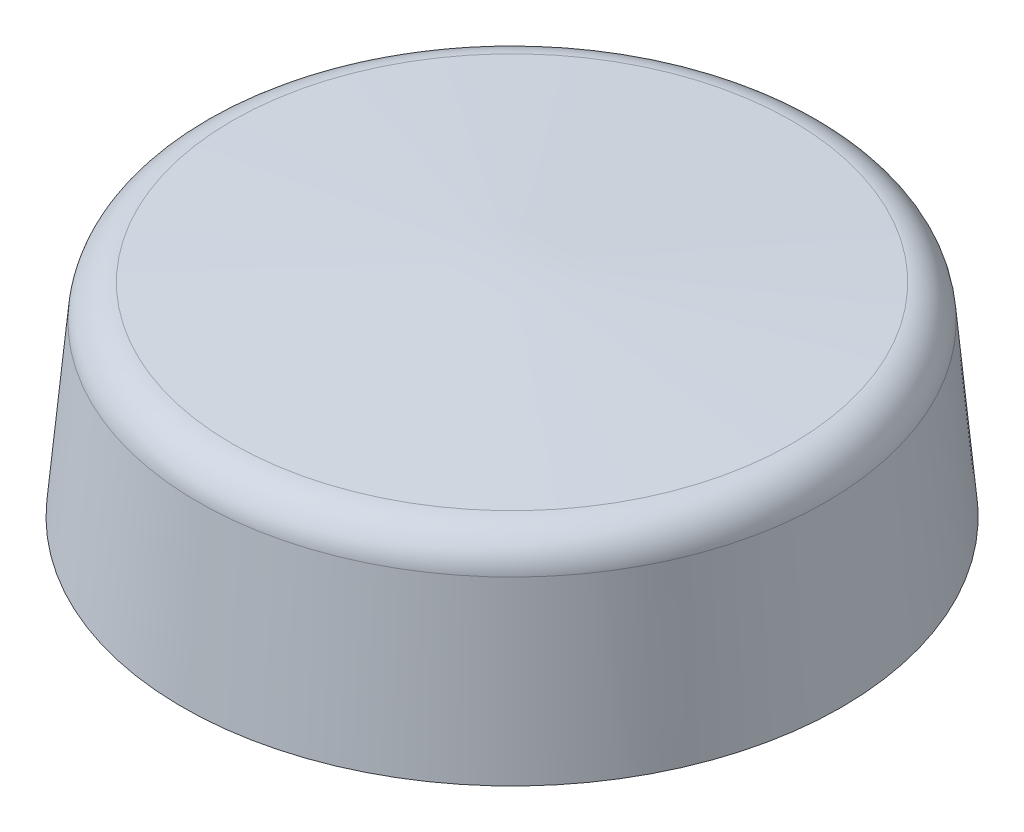
ISO-10303-21;
HEADER;
FILE_DESCRIPTION(('STEP AP214'),'2;1');
FILE_NAME('part.step','',(''),(''),'','','');
FILE_SCHEMA(('AUTOMOTIVE_DESIGN { 1 0 10303 214 1 1 1 1 }'));
ENDSEC;
DATA;
#1=APPLICATION_CONTEXT('core data for automotive mechanical design processes');
#2=APPLICATION_PROTOCOL_DEFINITION('international standard','automotive_design',2000,#1);
#3=PRODUCT_CONTEXT('',#1,'mechanical');
#4=PRODUCT('Part','Part','',(#3));
#5=PRODUCT_RELATED_PRODUCT_CATEGORY('part','',(#4));
#6=PRODUCT_DEFINITION_FORMATION('','',#4);
#7=PRODUCT_DEFINITION_CONTEXT('part definition',#1,'design');
#8=PRODUCT_DEFINITION('design','',#6,#7);
#9=PRODUCT_DEFINITION_SHAPE('','',#8);
#10=(LENGTH_UNIT() NAMED_UNIT(*) SI_UNIT(.MILLI.,.METRE.));
#11=(NAMED_UNIT(*) PLANE_ANGLE_UNIT() SI_UNIT($,.RADIAN.));
#12=(NAMED_UNIT(*) SI_UNIT($,.STERADIAN.) SOLID_ANGLE_UNIT());
#13=UNCERTAINTY_MEASURE_WITH_UNIT(LENGTH_MEASURE(1.E-05),#10,'distance_accuracy_value','');
#14=(GEOMETRIC_REPRESENTATION_CONTEXT(3) GLOBAL_UNCERTAINTY_ASSIGNED_CONTEXT((#13)) GLOBAL_UNIT_ASSIGNED_CONTEXT((#10,
#11,#12)) REPRESENTATION_CONTEXT('',''));
#15=CARTESIAN_POINT('',(0.,0.,0.));
#16=DIRECTION('',(0.,0.,1.));
#17=DIRECTION('',(1.,0.,0.));
#18=AXIS2_PLACEMENT_3D('',#15,#16,#17);
#19=CARTESIAN_POINT('',(0.,2.74999999999999,0.));
#20=DIRECTION('',(0.,-1.,0.));
#21=DIRECTION('',(1.,0.,0.));
#22=AXIS2_PLACEMENT_3D('',#19,#20,#21);
#23=CONICAL_SURFACE('',#22,4.25000000000001,1.51204050407917);
#24=CARTESIAN_POINT('',(0.,2.77527189355522,0.));
#25=DIRECTION('',(0.,1.,0.));
#26=DIRECTION('',(-1.,0.,0.));
#27=AXIS2_PLACEMENT_3D('',#24,#25,#26);
#28=CIRCLE('',#27,3.82037780956107);
#29=CARTESIAN_POINT('',(-3.82037780956108,2.77527189355521,0.));
#30=VERTEX_POINT('',#29);
#31=EDGE_CURVE('E11',#30,#30,#28,.T.);
#32=ORIENTED_EDGE('',*,*,#31,.T.);
#33=EDGE_LOOP('',(#32));
#34=FACE_BOUND('',#33,.T.);
#35=CARTESIAN_POINT('',(0.,3.,0.));
#36=VERTEX_POINT('',#35);
#37=VERTEX_LOOP('',#36);
#38=FACE_BOUND('',#37,.T.);
#39=ADVANCED_FACE('F43',(#34,#38),#23,.T.);
#40=CARTESIAN_POINT('',(4.5,0.,0.));
#41=DIRECTION('',(0.,-1.,0.));
#42=DIRECTION('',(1.,0.,0.));
#43=AXIS2_PLACEMENT_3D('',#40,#41,#42);
#44=PLANE('',#43);
#45=CARTESIAN_POINT('',(0.,0.,0.));
#46=DIRECTION('',(0.,-1.,0.));
#47=DIRECTION('',(1.,0.,0.));
#48=AXIS2_PLACEMENT_3D('',#45,#46,#47);
#49=CIRCLE('',#48,4.5);
#50=CARTESIAN_POINT('',(4.5,0.,0.));
#51=VERTEX_POINT('',#50);
#52=EDGE_CURVE('E75',#51,#51,#49,.T.);
#53=ORIENTED_EDGE('',*,*,#52,.T.);
#54=EDGE_LOOP('',(#53));
#55=FACE_BOUND('',#54,.T.);
#56=ADVANCED_FACE('F55',(#55),#44,.T.);
#57=CARTESIAN_POINT('',(0.,0.,0.));
#58=DIRECTION('',(0.,-1.,0.));
#59=DIRECTION('',(1.,0.,0.));
#60=AXIS2_PLACEMENT_3D('',#57,#58,#59);
#61=CONICAL_SURFACE('',#60,4.5,0.090659887200742);
#62=CARTESIAN_POINT('',(0.,2.32140257998897,0.));
#63=DIRECTION('',(0.,1.,0.));
#64=DIRECTION('',(-1.,0.,0.));
#65=AXIS2_PLACEMENT_3D('',#62,#63,#64);
#66=CIRCLE('',#65,4.28896340181919);
#67=CARTESIAN_POINT('',(-4.2889634018192,2.32140257998896,0.));
#68=VERTEX_POINT('',#67);
#69=EDGE_CURVE('E51',#68,#68,#66,.F.);
#70=ORIENTED_EDGE('',*,*,#69,.T.);
#71=EDGE_LOOP('',(#70));
#72=FACE_BOUND('',#71,.T.);
#73=ORIENTED_EDGE('',*,*,#52,.F.);
#74=EDGE_LOOP('',(#73));
#75=FACE_BOUND('',#74,.T.);
#76=ADVANCED_FACE('F60',(#72,#75),#61,.T.);
#77=CARTESIAN_POINT('',(0.,2.27613470696772,0.));
#78=DIRECTION('',(0.,1.,0.));
#79=DIRECTION('',(-1.,0.,0.));
#80=AXIS2_PLACEMENT_3D('',#77,#78,#79);
#81=TOROIDAL_SURFACE('',#80,3.79101679858534,0.5);
#82=ORIENTED_EDGE('',*,*,#31,.F.);
#83=EDGE_LOOP('',(#82));
#84=FACE_BOUND('',#83,.T.);
#85=ORIENTED_EDGE('',*,*,#69,.F.);
#86=EDGE_LOOP('',(#85));
#87=FACE_BOUND('',#86,.T.);
#88=ADVANCED_FACE('F45',(#84,#87),#81,.T.);
#89=CLOSED_SHELL('',(#39,#56,#76,#88));
#90=MANIFOLD_SOLID_BREP('B2',#89);
#91=ADVANCED_BREP_SHAPE_REPRESENTATION('',(#18,#90),#14);
#92=SHAPE_DEFINITION_REPRESENTATION(#9,#91);
ENDSEC;
END-ISO-10303-21;
